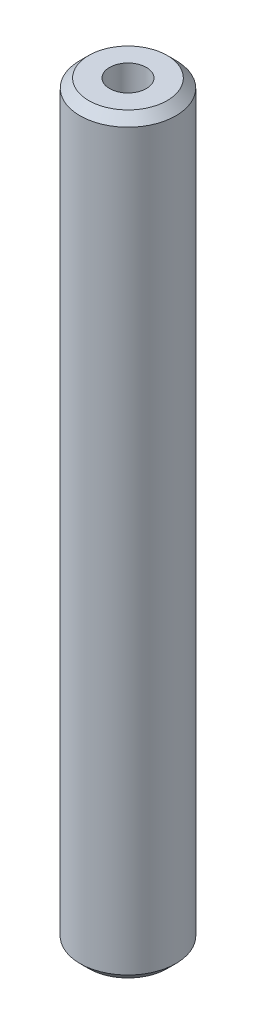
ISO-10303-21;
HEADER;
FILE_DESCRIPTION(('STEP AP214'),'2;1');
FILE_NAME('part.step','',(''),(''),'','','');
FILE_SCHEMA(('AUTOMOTIVE_DESIGN { 1 0 10303 214 1 1 1 1 }'));
ENDSEC;
DATA;
#1=APPLICATION_CONTEXT('core data for automotive mechanical design processes');
#2=APPLICATION_PROTOCOL_DEFINITION('international standard','automotive_design',2000,#1);
#3=PRODUCT_CONTEXT('',#1,'mechanical');
#4=PRODUCT('Part','Part','',(#3));
#5=PRODUCT_RELATED_PRODUCT_CATEGORY('part','',(#4));
#6=PRODUCT_DEFINITION_FORMATION('','',#4);
#7=PRODUCT_DEFINITION_CONTEXT('part definition',#1,'design');
#8=PRODUCT_DEFINITION('design','',#6,#7);
#9=PRODUCT_DEFINITION_SHAPE('','',#8);
#10=(LENGTH_UNIT() NAMED_UNIT(*) SI_UNIT(.MILLI.,.METRE.));
#11=(NAMED_UNIT(*) PLANE_ANGLE_UNIT() SI_UNIT($,.RADIAN.));
#12=(NAMED_UNIT(*) SI_UNIT($,.STERADIAN.) SOLID_ANGLE_UNIT());
#13=UNCERTAINTY_MEASURE_WITH_UNIT(LENGTH_MEASURE(1.E-05),#10,'distance_accuracy_value','');
#14=(GEOMETRIC_REPRESENTATION_CONTEXT(3) GLOBAL_UNCERTAINTY_ASSIGNED_CONTEXT((#13)) GLOBAL_UNIT_ASSIGNED_CONTEXT((#10,
#11,#12)) REPRESENTATION_CONTEXT('',''));
#15=CARTESIAN_POINT('',(0.,0.,0.));
#16=DIRECTION('',(0.,0.,1.));
#17=DIRECTION('',(1.,0.,0.));
#18=AXIS2_PLACEMENT_3D('',#15,#16,#17);
#19=CARTESIAN_POINT('',(0.,470.38901552347,0.));
#20=DIRECTION('',(0.,-1.,0.));
#21=DIRECTION('',(0.,0.,-1.));
#22=AXIS2_PLACEMENT_3D('',#19,#20,#21);
#23=CYLINDRICAL_SURFACE('',#22,30.);
#24=CARTESIAN_POINT('',(0.,464.905282222427,0.));
#25=DIRECTION('',(0.,1.,0.));
#26=DIRECTION('',(0.,0.,1.));
#27=AXIS2_PLACEMENT_3D('',#24,#25,#26);
#28=CIRCLE('',#27,30.);
#29=CARTESIAN_POINT('',(0.,464.905282222427,30.));
#30=VERTEX_POINT('',#29);
#31=EDGE_CURVE('E50',#30,#30,#28,.F.);
#32=ORIENTED_EDGE('',*,*,#31,.T.);
#33=EDGE_LOOP('',(#32));
#34=FACE_BOUND('',#33,.T.);
#35=CARTESIAN_POINT('',(0.,5.48373330104374,0.));
#36=DIRECTION('',(0.,1.,0.));
#37=DIRECTION('',(0.,0.,1.));
#38=AXIS2_PLACEMENT_3D('',#35,#36,#37);
#39=CIRCLE('',#38,30.);
#40=CARTESIAN_POINT('',(0.,5.48373330104374,30.));
#41=VERTEX_POINT('',#40);
#42=EDGE_CURVE('E51',#41,#41,#39,.T.);
#43=ORIENTED_EDGE('',*,*,#42,.T.);
#44=EDGE_LOOP('',(#43));
#45=FACE_BOUND('',#44,.T.);
#46=ADVANCED_FACE('F39',(#34,#45),#23,.T.);
#47=CARTESIAN_POINT('',(0.,470.38901552347,0.));
#48=DIRECTION('',(0.,1.,0.));
#49=DIRECTION('',(0.,0.,1.));
#50=AXIS2_PLACEMENT_3D('',#47,#48,#49);
#51=PLANE('',#50);
#52=CARTESIAN_POINT('',(0.,470.38901552347,0.));
#53=DIRECTION('',(0.,1.,0.));
#54=DIRECTION('',(0.,0.,1.));
#55=AXIS2_PLACEMENT_3D('',#52,#53,#54);
#56=CIRCLE('',#55,24.5162666989562);
#57=CARTESIAN_POINT('',(0.,470.38901552347,24.5162666989562));
#58=VERTEX_POINT('',#57);
#59=EDGE_CURVE('E54',#58,#58,#56,.T.);
#60=ORIENTED_EDGE('',*,*,#59,.T.);
#61=EDGE_LOOP('',(#60));
#62=FACE_BOUND('',#61,.T.);
#63=CARTESIAN_POINT('',(0.,470.38901552347,0.));
#64=DIRECTION('',(0.,1.,0.));
#65=DIRECTION('',(0.,0.,1.));
#66=AXIS2_PLACEMENT_3D('',#63,#64,#65);
#67=CIRCLE('',#66,11.5131131847476);
#68=CARTESIAN_POINT('',(0.,470.38901552347,11.5131131847476));
#69=VERTEX_POINT('',#68);
#70=EDGE_CURVE('E58',#69,#69,#67,.T.);
#71=ORIENTED_EDGE('',*,*,#70,.F.);
#72=EDGE_LOOP('',(#71));
#73=FACE_BOUND('',#72,.T.);
#74=ADVANCED_FACE('F69',(#62,#73),#51,.T.);
#75=CARTESIAN_POINT('',(0.,0.,0.));
#76=DIRECTION('',(0.,1.,0.));
#77=DIRECTION('',(0.,0.,1.));
#78=AXIS2_PLACEMENT_3D('',#75,#76,#77);
#79=PLANE('',#78);
#80=CARTESIAN_POINT('',(0.,0.,0.));
#81=DIRECTION('',(0.,1.,0.));
#82=DIRECTION('',(0.,0.,1.));
#83=AXIS2_PLACEMENT_3D('',#80,#81,#82);
#84=CIRCLE('',#83,24.5162666989562);
#85=CARTESIAN_POINT('',(0.,0.,24.5162666989562));
#86=VERTEX_POINT('',#85);
#87=EDGE_CURVE('E10',#86,#86,#84,.F.);
#88=ORIENTED_EDGE('',*,*,#87,.T.);
#89=EDGE_LOOP('',(#88));
#90=FACE_BOUND('',#89,.T.);
#91=CARTESIAN_POINT('',(0.,0.,0.));
#92=DIRECTION('',(0.,1.,0.));
#93=DIRECTION('',(0.,0.,1.));
#94=AXIS2_PLACEMENT_3D('',#91,#92,#93);
#95=CIRCLE('',#94,11.5131131847476);
#96=CARTESIAN_POINT('',(0.,0.,11.5131131847476));
#97=VERTEX_POINT('',#96);
#98=EDGE_CURVE('E63',#97,#97,#95,.T.);
#99=ORIENTED_EDGE('',*,*,#98,.T.);
#100=EDGE_LOOP('',(#99));
#101=FACE_BOUND('',#100,.T.);
#102=ADVANCED_FACE('F75',(#90,#101),#79,.F.);
#103=CARTESIAN_POINT('',(0.,470.38901552347,0.));
#104=DIRECTION('',(0.,-1.,0.));
#105=DIRECTION('',(0.,0.,-1.));
#106=AXIS2_PLACEMENT_3D('',#103,#104,#105);
#107=CYLINDRICAL_SURFACE('',#106,11.5131131847476);
#108=ORIENTED_EDGE('',*,*,#70,.T.);
#109=EDGE_LOOP('',(#108));
#110=FACE_BOUND('',#109,.T.);
#111=ORIENTED_EDGE('',*,*,#98,.F.);
#112=EDGE_LOOP('',(#111));
#113=FACE_BOUND('',#112,.T.);
#114=ADVANCED_FACE('F70',(#110,#113),#107,.F.);
#115=CARTESIAN_POINT('',(0.,470.38901552347,0.));
#116=DIRECTION('',(0.,-1.,0.));
#117=DIRECTION('',(0.,0.,-1.));
#118=AXIS2_PLACEMENT_3D('',#115,#116,#117);
#119=CONICAL_SURFACE('',#118,24.5162666989562,0.785398163397446);
#120=ORIENTED_EDGE('',*,*,#31,.F.);
#121=EDGE_LOOP('',(#120));
#122=FACE_BOUND('',#121,.T.);
#123=ORIENTED_EDGE('',*,*,#59,.F.);
#124=EDGE_LOOP('',(#123));
#125=FACE_BOUND('',#124,.T.);
#126=ADVANCED_FACE('F81',(#122,#125),#119,.T.);
#127=CARTESIAN_POINT('',(0.,5.48373330104374,0.));
#128=DIRECTION('',(0.,1.,0.));
#129=DIRECTION('',(0.,0.,1.));
#130=AXIS2_PLACEMENT_3D('',#127,#128,#129);
#131=CONICAL_SURFACE('',#130,30.,0.785398163397451);
#132=ORIENTED_EDGE('',*,*,#87,.F.);
#133=EDGE_LOOP('',(#132));
#134=FACE_BOUND('',#133,.T.);
#135=ORIENTED_EDGE('',*,*,#42,.F.);
#136=EDGE_LOOP('',(#135));
#137=FACE_BOUND('',#136,.T.);
#138=ADVANCED_FACE('F45',(#134,#137),#131,.T.);
#139=CLOSED_SHELL('',(#46,#74,#102,#114,#126,#138));
#140=MANIFOLD_SOLID_BREP('B2',#139);
#141=ADVANCED_BREP_SHAPE_REPRESENTATION('',(#18,#140),#14);
#142=SHAPE_DEFINITION_REPRESENTATION(#9,#141);
ENDSEC;
END-ISO-10303-21;
